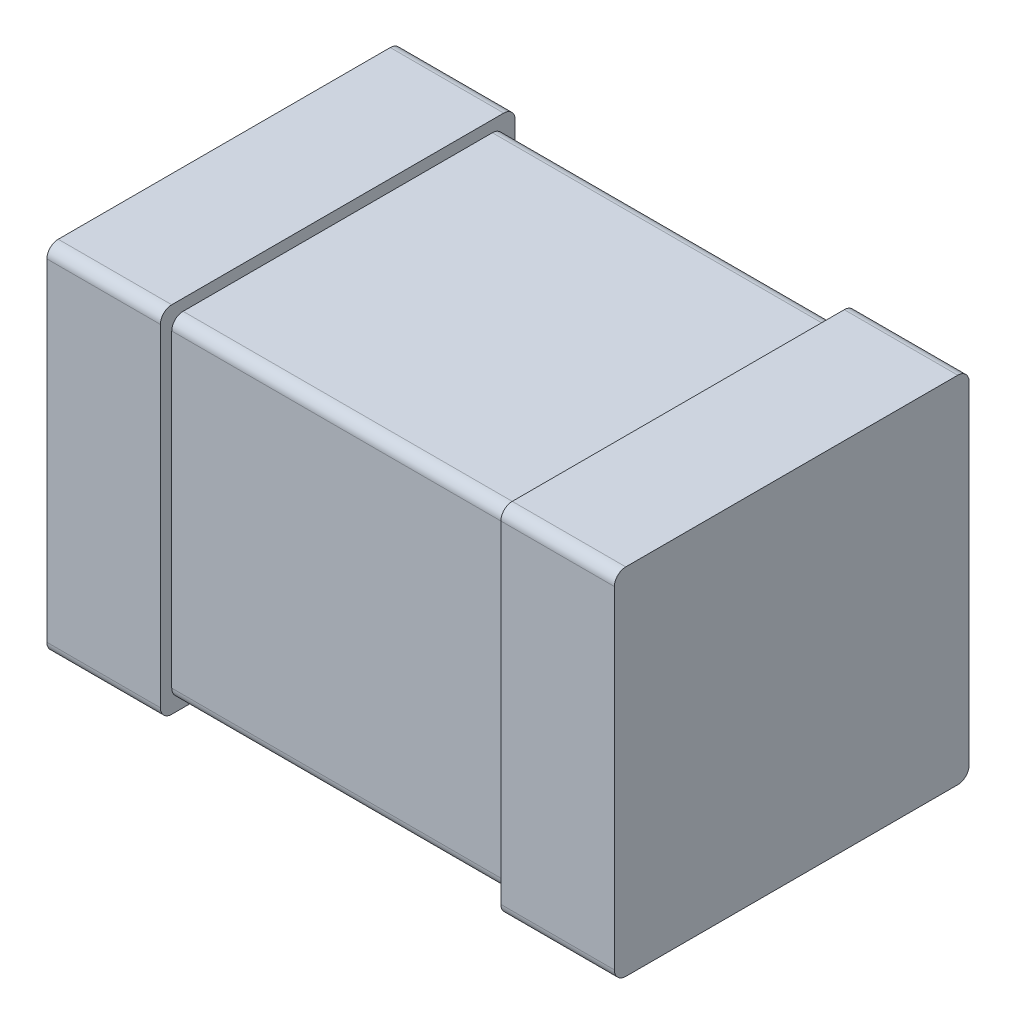
ISO-10303-21;
HEADER;
FILE_DESCRIPTION(('STEP AP214'),'2;1');
FILE_NAME('part.step','',(''),(''),'','','');
FILE_SCHEMA(('AUTOMOTIVE_DESIGN { 1 0 10303 214 1 1 1 1 }'));
ENDSEC;
DATA;
#1=APPLICATION_CONTEXT('core data for automotive mechanical design processes');
#2=APPLICATION_PROTOCOL_DEFINITION('international standard','automotive_design',2000,#1);
#3=PRODUCT_CONTEXT('',#1,'mechanical');
#4=PRODUCT('Part','Part','',(#3));
#5=PRODUCT_RELATED_PRODUCT_CATEGORY('part','',(#4));
#6=PRODUCT_DEFINITION_FORMATION('','',#4);
#7=PRODUCT_DEFINITION_CONTEXT('part definition',#1,'design');
#8=PRODUCT_DEFINITION('design','',#6,#7);
#9=PRODUCT_DEFINITION_SHAPE('','',#8);
#10=(LENGTH_UNIT() NAMED_UNIT(*) SI_UNIT(.MILLI.,.METRE.));
#11=(NAMED_UNIT(*) PLANE_ANGLE_UNIT() SI_UNIT($,.RADIAN.));
#12=(NAMED_UNIT(*) SI_UNIT($,.STERADIAN.) SOLID_ANGLE_UNIT());
#13=UNCERTAINTY_MEASURE_WITH_UNIT(LENGTH_MEASURE(1.E-05),#10,'distance_accuracy_value','');
#14=(GEOMETRIC_REPRESENTATION_CONTEXT(3) GLOBAL_UNCERTAINTY_ASSIGNED_CONTEXT((#13)) GLOBAL_UNIT_ASSIGNED_CONTEXT((#10,
#11,#12)) REPRESENTATION_CONTEXT('',''));
#15=CARTESIAN_POINT('',(0.,0.,0.));
#16=DIRECTION('',(0.,0.,1.));
#17=DIRECTION('',(1.,0.,0.));
#18=AXIS2_PLACEMENT_3D('',#15,#16,#17);
#19=CARTESIAN_POINT('',(-1.,-0.625,0.));
#20=DIRECTION('',(1.,0.,0.));
#21=DIRECTION('',(0.,1.,0.));
#22=AXIS2_PLACEMENT_3D('',#19,#20,#21);
#23=PLANE('',#22);
#24=CARTESIAN_POINT('',(-1.,-0.585,1.21));
#25=DIRECTION('',(-1.,0.,0.));
#26=DIRECTION('',(0.,0.,1.));
#27=AXIS2_PLACEMENT_3D('',#24,#25,#26);
#28=CIRCLE('',#27,0.04);
#29=CARTESIAN_POINT('',(-1.,-0.625,1.21));
#30=VERTEX_POINT('',#29);
#31=CARTESIAN_POINT('',(-1.,-0.585,1.25));
#32=VERTEX_POINT('',#31);
#33=EDGE_CURVE('E11',#30,#32,#28,.T.);
#34=ORIENTED_EDGE('',*,*,#33,.T.);
#35=DIRECTION('',(0.,1.,0.));
#36=VECTOR('',#35,1.);
#37=CARTESIAN_POINT('',(-1.,-0.625,1.25));
#38=LINE('',#37,#36);
#39=CARTESIAN_POINT('',(-1.,0.585,1.25));
#40=VERTEX_POINT('',#39);
#41=EDGE_CURVE('E27',#32,#40,#38,.T.);
#42=ORIENTED_EDGE('',*,*,#41,.T.);
#43=CARTESIAN_POINT('',(-1.,0.585,1.21));
#44=DIRECTION('',(1.,0.,0.));
#45=DIRECTION('',(0.,0.,1.));
#46=AXIS2_PLACEMENT_3D('',#43,#44,#45);
#47=CIRCLE('',#46,0.04);
#48=CARTESIAN_POINT('',(-1.,0.625,1.21));
#49=VERTEX_POINT('',#48);
#50=EDGE_CURVE('E176',#49,#40,#47,.T.);
#51=ORIENTED_EDGE('',*,*,#50,.F.);
#52=DIRECTION('',(0.,0.,1.));
#53=VECTOR('',#52,1.);
#54=CARTESIAN_POINT('',(-1.,0.625,0.));
#55=LINE('',#54,#53);
#56=CARTESIAN_POINT('',(-1.,0.625,0.04));
#57=VERTEX_POINT('',#56);
#58=EDGE_CURVE('E166',#57,#49,#55,.T.);
#59=ORIENTED_EDGE('',*,*,#58,.F.);
#60=CARTESIAN_POINT('',(-1.,0.585,0.04));
#61=DIRECTION('',(-1.,0.,0.));
#62=DIRECTION('',(0.,0.,1.));
#63=AXIS2_PLACEMENT_3D('',#60,#61,#62);
#64=CIRCLE('',#63,0.04);
#65=CARTESIAN_POINT('',(-1.,0.585,0.));
#66=VERTEX_POINT('',#65);
#67=EDGE_CURVE('E174',#57,#66,#64,.T.);
#68=ORIENTED_EDGE('',*,*,#67,.T.);
#69=DIRECTION('',(0.,1.,0.));
#70=VECTOR('',#69,1.);
#71=CARTESIAN_POINT('',(-1.,-0.625,0.));
#72=LINE('',#71,#70);
#73=CARTESIAN_POINT('',(-1.,-0.585,0.));
#74=VERTEX_POINT('',#73);
#75=EDGE_CURVE('E228',#74,#66,#72,.T.);
#76=ORIENTED_EDGE('',*,*,#75,.F.);
#77=CARTESIAN_POINT('',(-1.,-0.585,0.04));
#78=DIRECTION('',(1.,0.,0.));
#79=DIRECTION('',(0.,0.,1.));
#80=AXIS2_PLACEMENT_3D('',#77,#78,#79);
#81=CIRCLE('',#80,0.04);
#82=CARTESIAN_POINT('',(-1.,-0.625,0.04));
#83=VERTEX_POINT('',#82);
#84=EDGE_CURVE('E306',#83,#74,#81,.T.);
#85=ORIENTED_EDGE('',*,*,#84,.F.);
#86=DIRECTION('',(0.,0.,1.));
#87=VECTOR('',#86,1.);
#88=CARTESIAN_POINT('',(-1.,-0.625,0.));
#89=LINE('',#88,#87);
#90=EDGE_CURVE('E191',#83,#30,#89,.T.);
#91=ORIENTED_EDGE('',*,*,#90,.T.);
#92=EDGE_LOOP('',(#34,#42,#51,#59,#68,#76,#85,#91));
#93=FACE_BOUND('',#92,.T.);
#94=ADVANCED_FACE('F16',(#93),#23,.F.);
#95=CARTESIAN_POINT('',(-1.,-0.625,0.));
#96=DIRECTION('',(0.,1.,0.));
#97=DIRECTION('',(1.,0.,0.));
#98=AXIS2_PLACEMENT_3D('',#95,#96,#97);
#99=PLANE('',#98);
#100=DIRECTION('',(1.,0.,0.));
#101=VECTOR('',#100,1.);
#102=CARTESIAN_POINT('',(-1.,-0.625,1.21));
#103=LINE('',#102,#101);
#104=CARTESIAN_POINT('',(-0.6,-0.625,1.21));
#105=VERTEX_POINT('',#104);
#106=EDGE_CURVE('E489',#30,#105,#103,.T.);
#107=ORIENTED_EDGE('',*,*,#106,.F.);
#108=ORIENTED_EDGE('',*,*,#90,.F.);
#109=DIRECTION('',(1.,0.,0.));
#110=VECTOR('',#109,1.);
#111=CARTESIAN_POINT('',(-1.,-0.625,0.04));
#112=LINE('',#111,#110);
#113=CARTESIAN_POINT('',(-0.6,-0.625,0.04));
#114=VERTEX_POINT('',#113);
#115=EDGE_CURVE('E350',#83,#114,#112,.T.);
#116=ORIENTED_EDGE('',*,*,#115,.T.);
#117=DIRECTION('',(0.,0.,1.));
#118=VECTOR('',#117,1.);
#119=CARTESIAN_POINT('',(-0.6,-0.625,0.));
#120=LINE('',#119,#118);
#121=EDGE_CURVE('E310',#114,#105,#120,.T.);
#122=ORIENTED_EDGE('',*,*,#121,.T.);
#123=EDGE_LOOP('',(#107,#108,#116,#122));
#124=FACE_BOUND('',#123,.T.);
#125=ADVANCED_FACE('F579',(#124),#99,.F.);
#126=CARTESIAN_POINT('',(-1.,-0.585,0.04));
#127=DIRECTION('',(1.,0.,0.));
#128=DIRECTION('',(0.,-1.,0.));
#129=AXIS2_PLACEMENT_3D('',#126,#127,#128);
#130=CYLINDRICAL_SURFACE('',#129,0.04);
#131=ORIENTED_EDGE('',*,*,#84,.T.);
#132=DIRECTION('',(1.,0.,0.));
#133=VECTOR('',#132,1.);
#134=CARTESIAN_POINT('',(-1.,-0.585,0.));
#135=LINE('',#134,#133);
#136=CARTESIAN_POINT('',(-0.6,-0.585,0.));
#137=VERTEX_POINT('',#136);
#138=EDGE_CURVE('E311',#74,#137,#135,.T.);
#139=ORIENTED_EDGE('',*,*,#138,.T.);
#140=CARTESIAN_POINT('',(-0.6,-0.585,0.04));
#141=DIRECTION('',(1.,0.,0.));
#142=DIRECTION('',(0.,0.,1.));
#143=AXIS2_PLACEMENT_3D('',#140,#141,#142);
#144=CIRCLE('',#143,0.04);
#145=EDGE_CURVE('E331',#114,#137,#144,.T.);
#146=ORIENTED_EDGE('',*,*,#145,.F.);
#147=ORIENTED_EDGE('',*,*,#115,.F.);
#148=EDGE_LOOP('',(#131,#139,#146,#147));
#149=FACE_BOUND('',#148,.T.);
#150=ADVANCED_FACE('F581',(#149),#130,.T.);
#151=CARTESIAN_POINT('',(-1.,-0.585,1.21));
#152=DIRECTION('',(1.,0.,0.));
#153=DIRECTION('',(0.,-1.,0.));
#154=AXIS2_PLACEMENT_3D('',#151,#152,#153);
#155=CYLINDRICAL_SURFACE('',#154,0.04);
#156=ORIENTED_EDGE('',*,*,#106,.T.);
#157=CARTESIAN_POINT('',(-0.6,-0.585,1.21));
#158=DIRECTION('',(-1.,0.,0.));
#159=DIRECTION('',(0.,0.,1.));
#160=AXIS2_PLACEMENT_3D('',#157,#158,#159);
#161=CIRCLE('',#160,0.04);
#162=CARTESIAN_POINT('',(-0.6,-0.585,1.25));
#163=VERTEX_POINT('',#162);
#164=EDGE_CURVE('E500',#105,#163,#161,.T.);
#165=ORIENTED_EDGE('',*,*,#164,.T.);
#166=DIRECTION('',(1.,0.,0.));
#167=VECTOR('',#166,1.);
#168=CARTESIAN_POINT('',(-1.,-0.585,1.25));
#169=LINE('',#168,#167);
#170=EDGE_CURVE('E205',#32,#163,#169,.T.);
#171=ORIENTED_EDGE('',*,*,#170,.F.);
#172=ORIENTED_EDGE('',*,*,#33,.F.);
#173=EDGE_LOOP('',(#156,#165,#171,#172));
#174=FACE_BOUND('',#173,.T.);
#175=ADVANCED_FACE('F635',(#174),#155,.T.);
#176=CARTESIAN_POINT('',(-1.,-0.625,0.));
#177=DIRECTION('',(0.,0.,1.));
#178=DIRECTION('',(1.,0.,0.));
#179=AXIS2_PLACEMENT_3D('',#176,#177,#178);
#180=PLANE('',#179);
#181=DIRECTION('',(1.,0.,0.));
#182=VECTOR('',#181,1.);
#183=CARTESIAN_POINT('',(-1.,0.585,0.));
#184=LINE('',#183,#182);
#185=CARTESIAN_POINT('',(-0.6,0.585,0.));
#186=VERTEX_POINT('',#185);
#187=EDGE_CURVE('E189',#66,#186,#184,.T.);
#188=ORIENTED_EDGE('',*,*,#187,.T.);
#189=DIRECTION('',(0.,1.,0.));
#190=VECTOR('',#189,1.);
#191=CARTESIAN_POINT('',(-0.6,-0.625,0.));
#192=LINE('',#191,#190);
#193=EDGE_CURVE('E341',#137,#186,#192,.T.);
#194=ORIENTED_EDGE('',*,*,#193,.F.);
#195=ORIENTED_EDGE('',*,*,#138,.F.);
#196=ORIENTED_EDGE('',*,*,#75,.T.);
#197=EDGE_LOOP('',(#188,#194,#195,#196));
#198=FACE_BOUND('',#197,.T.);
#199=ADVANCED_FACE('F641',(#198),#180,.F.);
#200=CARTESIAN_POINT('',(-1.,-0.625,1.25));
#201=DIRECTION('',(0.,0.,1.));
#202=DIRECTION('',(1.,0.,0.));
#203=AXIS2_PLACEMENT_3D('',#200,#201,#202);
#204=PLANE('',#203);
#205=ORIENTED_EDGE('',*,*,#41,.F.);
#206=ORIENTED_EDGE('',*,*,#170,.T.);
#207=DIRECTION('',(0.,1.,0.));
#208=VECTOR('',#207,1.);
#209=CARTESIAN_POINT('',(-0.6,-0.625,1.25));
#210=LINE('',#209,#208);
#211=CARTESIAN_POINT('',(-0.6,0.585,1.25));
#212=VERTEX_POINT('',#211);
#213=EDGE_CURVE('E197',#163,#212,#210,.T.);
#214=ORIENTED_EDGE('',*,*,#213,.T.);
#215=DIRECTION('',(1.,0.,0.));
#216=VECTOR('',#215,1.);
#217=CARTESIAN_POINT('',(-1.,0.585,1.25));
#218=LINE('',#217,#216);
#219=EDGE_CURVE('E179',#40,#212,#218,.T.);
#220=ORIENTED_EDGE('',*,*,#219,.F.);
#221=EDGE_LOOP('',(#205,#206,#214,#220));
#222=FACE_BOUND('',#221,.T.);
#223=ADVANCED_FACE('F445',(#222),#204,.T.);
#224=CARTESIAN_POINT('',(-1.,0.585,0.04));
#225=DIRECTION('',(1.,0.,0.));
#226=DIRECTION('',(0.,1.,0.));
#227=AXIS2_PLACEMENT_3D('',#224,#225,#226);
#228=CYLINDRICAL_SURFACE('',#227,0.04);
#229=DIRECTION('',(1.,0.,0.));
#230=VECTOR('',#229,1.);
#231=CARTESIAN_POINT('',(-1.,0.625,0.04));
#232=LINE('',#231,#230);
#233=CARTESIAN_POINT('',(-0.6,0.625,0.04));
#234=VERTEX_POINT('',#233);
#235=EDGE_CURVE('E186',#57,#234,#232,.T.);
#236=ORIENTED_EDGE('',*,*,#235,.T.);
#237=CARTESIAN_POINT('',(-0.6,0.585,0.04));
#238=DIRECTION('',(-1.,0.,0.));
#239=DIRECTION('',(0.,0.,1.));
#240=AXIS2_PLACEMENT_3D('',#237,#238,#239);
#241=CIRCLE('',#240,0.04);
#242=EDGE_CURVE('E198',#234,#186,#241,.T.);
#243=ORIENTED_EDGE('',*,*,#242,.T.);
#244=ORIENTED_EDGE('',*,*,#187,.F.);
#245=ORIENTED_EDGE('',*,*,#67,.F.);
#246=EDGE_LOOP('',(#236,#243,#244,#245));
#247=FACE_BOUND('',#246,.T.);
#248=ADVANCED_FACE('F184',(#247),#228,.T.);
#249=CARTESIAN_POINT('',(-1.,0.585,1.21));
#250=DIRECTION('',(1.,0.,0.));
#251=DIRECTION('',(0.,1.,0.));
#252=AXIS2_PLACEMENT_3D('',#249,#250,#251);
#253=CYLINDRICAL_SURFACE('',#252,0.04);
#254=ORIENTED_EDGE('',*,*,#50,.T.);
#255=ORIENTED_EDGE('',*,*,#219,.T.);
#256=CARTESIAN_POINT('',(-0.6,0.585,1.21));
#257=DIRECTION('',(1.,0.,0.));
#258=DIRECTION('',(0.,0.,1.));
#259=AXIS2_PLACEMENT_3D('',#256,#257,#258);
#260=CIRCLE('',#259,0.04);
#261=CARTESIAN_POINT('',(-0.6,0.625,1.21));
#262=VERTEX_POINT('',#261);
#263=EDGE_CURVE('E427',#262,#212,#260,.T.);
#264=ORIENTED_EDGE('',*,*,#263,.F.);
#265=DIRECTION('',(1.,0.,0.));
#266=VECTOR('',#265,1.);
#267=CARTESIAN_POINT('',(-1.,0.625,1.21));
#268=LINE('',#267,#266);
#269=EDGE_CURVE('E180',#49,#262,#268,.T.);
#270=ORIENTED_EDGE('',*,*,#269,.F.);
#271=EDGE_LOOP('',(#254,#255,#264,#270));
#272=FACE_BOUND('',#271,.T.);
#273=ADVANCED_FACE('F454',(#272),#253,.T.);
#274=CARTESIAN_POINT('',(-1.,0.625,0.));
#275=DIRECTION('',(0.,1.,0.));
#276=DIRECTION('',(1.,0.,0.));
#277=AXIS2_PLACEMENT_3D('',#274,#275,#276);
#278=PLANE('',#277);
#279=DIRECTION('',(0.,0.,1.));
#280=VECTOR('',#279,1.);
#281=CARTESIAN_POINT('',(-0.6,0.625,0.));
#282=LINE('',#281,#280);
#283=EDGE_CURVE('E195',#234,#262,#282,.T.);
#284=ORIENTED_EDGE('',*,*,#283,.F.);
#285=ORIENTED_EDGE('',*,*,#235,.F.);
#286=ORIENTED_EDGE('',*,*,#58,.T.);
#287=ORIENTED_EDGE('',*,*,#269,.T.);
#288=EDGE_LOOP('',(#284,#285,#286,#287));
#289=FACE_BOUND('',#288,.T.);
#290=ADVANCED_FACE('F193',(#289),#278,.T.);
#291=CARTESIAN_POINT('',(-0.6,-0.625,0.));
#292=DIRECTION('',(1.,0.,0.));
#293=DIRECTION('',(0.,1.,0.));
#294=AXIS2_PLACEMENT_3D('',#291,#292,#293);
#295=PLANE('',#294);
#296=ORIENTED_EDGE('',*,*,#121,.F.);
#297=ORIENTED_EDGE('',*,*,#145,.T.);
#298=ORIENTED_EDGE('',*,*,#193,.T.);
#299=ORIENTED_EDGE('',*,*,#242,.F.);
#300=ORIENTED_EDGE('',*,*,#283,.T.);
#301=ORIENTED_EDGE('',*,*,#263,.T.);
#302=ORIENTED_EDGE('',*,*,#213,.F.);
#303=ORIENTED_EDGE('',*,*,#164,.F.);
#304=EDGE_LOOP('',(#296,#297,#298,#299,#300,#301,#302,#303));
#305=FACE_BOUND('',#304,.T.);
#306=CARTESIAN_POINT('',(-0.6,-0.545,0.08));
#307=DIRECTION('',(1.,0.,0.));
#308=DIRECTION('',(0.,0.,1.));
#309=AXIS2_PLACEMENT_3D('',#306,#307,#308);
#310=CIRCLE('',#309,0.04);
#311=CARTESIAN_POINT('',(-0.6,-0.585,0.08));
#312=VERTEX_POINT('',#311);
#313=CARTESIAN_POINT('',(-0.6,-0.545,0.04));
#314=VERTEX_POINT('',#313);
#315=EDGE_CURVE('E213',#312,#314,#310,.T.);
#316=ORIENTED_EDGE('',*,*,#315,.F.);
#317=DIRECTION('',(0.,0.,1.));
#318=VECTOR('',#317,1.);
#319=CARTESIAN_POINT('',(-0.6,-0.585,0.04));
#320=LINE('',#319,#318);
#321=CARTESIAN_POINT('',(-0.6,-0.585,1.17));
#322=VERTEX_POINT('',#321);
#323=EDGE_CURVE('E244',#312,#322,#320,.T.);
#324=ORIENTED_EDGE('',*,*,#323,.T.);
#325=CARTESIAN_POINT('',(-0.6,-0.545,1.17));
#326=DIRECTION('',(-1.,0.,0.));
#327=DIRECTION('',(0.,0.,1.));
#328=AXIS2_PLACEMENT_3D('',#325,#326,#327);
#329=CIRCLE('',#328,0.04);
#330=CARTESIAN_POINT('',(-0.6,-0.545,1.21));
#331=VERTEX_POINT('',#330);
#332=EDGE_CURVE('E75',#322,#331,#329,.T.);
#333=ORIENTED_EDGE('',*,*,#332,.T.);
#334=DIRECTION('',(0.,1.,0.));
#335=VECTOR('',#334,1.);
#336=CARTESIAN_POINT('',(-0.6,-0.585,1.21));
#337=LINE('',#336,#335);
#338=CARTESIAN_POINT('',(-0.6,0.545,1.21));
#339=VERTEX_POINT('',#338);
#340=EDGE_CURVE('E91',#331,#339,#337,.T.);
#341=ORIENTED_EDGE('',*,*,#340,.T.);
#342=CARTESIAN_POINT('',(-0.6,0.545,1.17));
#343=DIRECTION('',(1.,0.,0.));
#344=DIRECTION('',(0.,0.,1.));
#345=AXIS2_PLACEMENT_3D('',#342,#343,#344);
#346=CIRCLE('',#345,0.04);
#347=CARTESIAN_POINT('',(-0.6,0.585,1.17));
#348=VERTEX_POINT('',#347);
#349=EDGE_CURVE('E435',#348,#339,#346,.T.);
#350=ORIENTED_EDGE('',*,*,#349,.F.);
#351=DIRECTION('',(0.,0.,1.));
#352=VECTOR('',#351,1.);
#353=CARTESIAN_POINT('',(-0.6,0.585,0.04));
#354=LINE('',#353,#352);
#355=CARTESIAN_POINT('',(-0.6,0.585,0.08));
#356=VERTEX_POINT('',#355);
#357=EDGE_CURVE('E335',#356,#348,#354,.T.);
#358=ORIENTED_EDGE('',*,*,#357,.F.);
#359=CARTESIAN_POINT('',(-0.6,0.545,0.08));
#360=DIRECTION('',(-1.,0.,0.));
#361=DIRECTION('',(0.,0.,1.));
#362=AXIS2_PLACEMENT_3D('',#359,#360,#361);
#363=CIRCLE('',#362,0.04);
#364=CARTESIAN_POINT('',(-0.6,0.545,0.04));
#365=VERTEX_POINT('',#364);
#366=EDGE_CURVE('E216',#356,#365,#363,.T.);
#367=ORIENTED_EDGE('',*,*,#366,.T.);
#368=DIRECTION('',(0.,1.,0.));
#369=VECTOR('',#368,1.);
#370=CARTESIAN_POINT('',(-0.6,-0.585,0.04));
#371=LINE('',#370,#369);
#372=EDGE_CURVE('E222',#314,#365,#371,.T.);
#373=ORIENTED_EDGE('',*,*,#372,.F.);
#374=EDGE_LOOP('',(#316,#324,#333,#341,#350,#358,#367,#373));
#375=FACE_BOUND('',#374,.T.);
#376=ADVANCED_FACE('F451',(#305,#375),#295,.T.);
#377=CARTESIAN_POINT('',(-0.6,-0.545,0.08));
#378=DIRECTION('',(1.,0.,0.));
#379=DIRECTION('',(0.,-1.,0.));
#380=AXIS2_PLACEMENT_3D('',#377,#378,#379);
#381=CYLINDRICAL_SURFACE('',#380,0.04);
#382=ORIENTED_EDGE('',*,*,#315,.T.);
#383=DIRECTION('',(1.,0.,0.));
#384=VECTOR('',#383,1.);
#385=CARTESIAN_POINT('',(-0.6,-0.545,0.04));
#386=LINE('',#385,#384);
#387=CARTESIAN_POINT('',(0.6,-0.545,0.04));
#388=VERTEX_POINT('',#387);
#389=EDGE_CURVE('E217',#314,#388,#386,.T.);
#390=ORIENTED_EDGE('',*,*,#389,.T.);
#391=CARTESIAN_POINT('',(0.6,-0.545,0.08));
#392=DIRECTION('',(1.,0.,0.));
#393=DIRECTION('',(0.,0.,1.));
#394=AXIS2_PLACEMENT_3D('',#391,#392,#393);
#395=CIRCLE('',#394,0.04);
#396=CARTESIAN_POINT('',(0.6,-0.585,0.08));
#397=VERTEX_POINT('',#396);
#398=EDGE_CURVE('E239',#397,#388,#395,.T.);
#399=ORIENTED_EDGE('',*,*,#398,.F.);
#400=DIRECTION('',(1.,0.,0.));
#401=VECTOR('',#400,1.);
#402=CARTESIAN_POINT('',(-0.6,-0.585,0.08));
#403=LINE('',#402,#401);
#404=EDGE_CURVE('E278',#312,#397,#403,.T.);
#405=ORIENTED_EDGE('',*,*,#404,.F.);
#406=EDGE_LOOP('',(#382,#390,#399,#405));
#407=FACE_BOUND('',#406,.T.);
#408=ADVANCED_FACE('F658',(#407),#381,.T.);
#409=CARTESIAN_POINT('',(-0.6,-0.585,0.04));
#410=DIRECTION('',(0.,0.,1.));
#411=DIRECTION('',(1.,0.,0.));
#412=AXIS2_PLACEMENT_3D('',#409,#410,#411);
#413=PLANE('',#412);
#414=DIRECTION('',(1.,0.,0.));
#415=VECTOR('',#414,1.);
#416=CARTESIAN_POINT('',(-0.6,0.545,0.04));
#417=LINE('',#416,#415);
#418=CARTESIAN_POINT('',(0.6,0.545,0.04));
#419=VERTEX_POINT('',#418);
#420=EDGE_CURVE('E218',#365,#419,#417,.T.);
#421=ORIENTED_EDGE('',*,*,#420,.T.);
#422=DIRECTION('',(0.,1.,0.));
#423=VECTOR('',#422,1.);
#424=CARTESIAN_POINT('',(0.6,-0.585,0.04));
#425=LINE('',#424,#423);
#426=EDGE_CURVE('E229',#388,#419,#425,.T.);
#427=ORIENTED_EDGE('',*,*,#426,.F.);
#428=ORIENTED_EDGE('',*,*,#389,.F.);
#429=ORIENTED_EDGE('',*,*,#372,.T.);
#430=EDGE_LOOP('',(#421,#427,#428,#429));
#431=FACE_BOUND('',#430,.T.);
#432=ADVANCED_FACE('F662',(#431),#413,.F.);
#433=CARTESIAN_POINT('',(-0.6,0.545,0.08));
#434=DIRECTION('',(1.,0.,0.));
#435=DIRECTION('',(0.,1.,0.));
#436=AXIS2_PLACEMENT_3D('',#433,#434,#435);
#437=CYLINDRICAL_SURFACE('',#436,0.04);
#438=DIRECTION('',(1.,0.,0.));
#439=VECTOR('',#438,1.);
#440=CARTESIAN_POINT('',(-0.6,0.585,0.08));
#441=LINE('',#440,#439);
#442=CARTESIAN_POINT('',(0.6,0.585,0.08));
#443=VERTEX_POINT('',#442);
#444=EDGE_CURVE('E245',#356,#443,#441,.T.);
#445=ORIENTED_EDGE('',*,*,#444,.T.);
#446=CARTESIAN_POINT('',(0.6,0.545,0.08));
#447=DIRECTION('',(-1.,0.,0.));
#448=DIRECTION('',(0.,0.,1.));
#449=AXIS2_PLACEMENT_3D('',#446,#447,#448);
#450=CIRCLE('',#449,0.04);
#451=EDGE_CURVE('E249',#443,#419,#450,.T.);
#452=ORIENTED_EDGE('',*,*,#451,.T.);
#453=ORIENTED_EDGE('',*,*,#420,.F.);
#454=ORIENTED_EDGE('',*,*,#366,.F.);
#455=EDGE_LOOP('',(#445,#452,#453,#454));
#456=FACE_BOUND('',#455,.T.);
#457=ADVANCED_FACE('F688',(#456),#437,.T.);
#458=CARTESIAN_POINT('',(-0.6,0.585,0.04));
#459=DIRECTION('',(0.,1.,0.));
#460=DIRECTION('',(1.,0.,0.));
#461=AXIS2_PLACEMENT_3D('',#458,#459,#460);
#462=PLANE('',#461);
#463=DIRECTION('',(0.,0.,1.));
#464=VECTOR('',#463,1.);
#465=CARTESIAN_POINT('',(0.6,0.585,0.04));
#466=LINE('',#465,#464);
#467=CARTESIAN_POINT('',(0.6,0.585,1.17));
#468=VERTEX_POINT('',#467);
#469=EDGE_CURVE('E234',#443,#468,#466,.T.);
#470=ORIENTED_EDGE('',*,*,#469,.F.);
#471=ORIENTED_EDGE('',*,*,#444,.F.);
#472=ORIENTED_EDGE('',*,*,#357,.T.);
#473=DIRECTION('',(1.,0.,0.));
#474=VECTOR('',#473,1.);
#475=CARTESIAN_POINT('',(-0.6,0.585,1.17));
#476=LINE('',#475,#474);
#477=EDGE_CURVE('E423',#348,#468,#476,.T.);
#478=ORIENTED_EDGE('',*,*,#477,.T.);
#479=EDGE_LOOP('',(#470,#471,#472,#478));
#480=FACE_BOUND('',#479,.T.);
#481=ADVANCED_FACE('F553',(#480),#462,.T.);
#482=CARTESIAN_POINT('',(-0.6,0.545,1.17));
#483=DIRECTION('',(1.,0.,0.));
#484=DIRECTION('',(0.,1.,0.));
#485=AXIS2_PLACEMENT_3D('',#482,#483,#484);
#486=CYLINDRICAL_SURFACE('',#485,0.04);
#487=ORIENTED_EDGE('',*,*,#349,.T.);
#488=DIRECTION('',(1.,0.,0.));
#489=VECTOR('',#488,1.);
#490=CARTESIAN_POINT('',(-0.6,0.545,1.21));
#491=LINE('',#490,#489);
#492=CARTESIAN_POINT('',(0.6,0.545,1.21));
#493=VERTEX_POINT('',#492);
#494=EDGE_CURVE('E431',#339,#493,#491,.T.);
#495=ORIENTED_EDGE('',*,*,#494,.T.);
#496=CARTESIAN_POINT('',(0.6,0.545,1.17));
#497=DIRECTION('',(1.,0.,0.));
#498=DIRECTION('',(0.,0.,1.));
#499=AXIS2_PLACEMENT_3D('',#496,#497,#498);
#500=CIRCLE('',#499,0.04);
#501=EDGE_CURVE('E235',#468,#493,#500,.T.);
#502=ORIENTED_EDGE('',*,*,#501,.F.);
#503=ORIENTED_EDGE('',*,*,#477,.F.);
#504=EDGE_LOOP('',(#487,#495,#502,#503));
#505=FACE_BOUND('',#504,.T.);
#506=ADVANCED_FACE('F555',(#505),#486,.T.);
#507=CARTESIAN_POINT('',(-0.6,-0.585,1.21));
#508=DIRECTION('',(0.,0.,1.));
#509=DIRECTION('',(1.,0.,0.));
#510=AXIS2_PLACEMENT_3D('',#507,#508,#509);
#511=PLANE('',#510);
#512=ORIENTED_EDGE('',*,*,#340,.F.);
#513=DIRECTION('',(1.,0.,0.));
#514=VECTOR('',#513,1.);
#515=CARTESIAN_POINT('',(-0.6,-0.545,1.21));
#516=LINE('',#515,#514);
#517=CARTESIAN_POINT('',(0.6,-0.545,1.21));
#518=VERTEX_POINT('',#517);
#519=EDGE_CURVE('E272',#331,#518,#516,.T.);
#520=ORIENTED_EDGE('',*,*,#519,.T.);
#521=DIRECTION('',(0.,1.,0.));
#522=VECTOR('',#521,1.);
#523=CARTESIAN_POINT('',(0.6,-0.585,1.21));
#524=LINE('',#523,#522);
#525=EDGE_CURVE('E268',#518,#493,#524,.T.);
#526=ORIENTED_EDGE('',*,*,#525,.T.);
#527=ORIENTED_EDGE('',*,*,#494,.F.);
#528=EDGE_LOOP('',(#512,#520,#526,#527));
#529=FACE_BOUND('',#528,.T.);
#530=ADVANCED_FACE('F724',(#529),#511,.T.);
#531=CARTESIAN_POINT('',(-0.6,-0.545,1.17));
#532=DIRECTION('',(1.,0.,0.));
#533=DIRECTION('',(0.,-1.,0.));
#534=AXIS2_PLACEMENT_3D('',#531,#532,#533);
#535=CYLINDRICAL_SURFACE('',#534,0.04);
#536=DIRECTION('',(1.,0.,0.));
#537=VECTOR('',#536,1.);
#538=CARTESIAN_POINT('',(-0.6,-0.585,1.17));
#539=LINE('',#538,#537);
#540=CARTESIAN_POINT('',(0.6,-0.585,1.17));
#541=VERTEX_POINT('',#540);
#542=EDGE_CURVE('E273',#322,#541,#539,.T.);
#543=ORIENTED_EDGE('',*,*,#542,.T.);
#544=CARTESIAN_POINT('',(0.6,-0.545,1.17));
#545=DIRECTION('',(-1.,0.,0.));
#546=DIRECTION('',(0.,0.,1.));
#547=AXIS2_PLACEMENT_3D('',#544,#545,#546);
#548=CIRCLE('',#547,0.04);
#549=EDGE_CURVE('E274',#541,#518,#548,.T.);
#550=ORIENTED_EDGE('',*,*,#549,.T.);
#551=ORIENTED_EDGE('',*,*,#519,.F.);
#552=ORIENTED_EDGE('',*,*,#332,.F.);
#553=EDGE_LOOP('',(#543,#550,#551,#552));
#554=FACE_BOUND('',#553,.T.);
#555=ADVANCED_FACE('F362',(#554),#535,.T.);
#556=CARTESIAN_POINT('',(-0.6,-0.585,0.04));
#557=DIRECTION('',(0.,1.,0.));
#558=DIRECTION('',(1.,0.,0.));
#559=AXIS2_PLACEMENT_3D('',#556,#557,#558);
#560=PLANE('',#559);
#561=ORIENTED_EDGE('',*,*,#542,.F.);
#562=ORIENTED_EDGE('',*,*,#323,.F.);
#563=ORIENTED_EDGE('',*,*,#404,.T.);
#564=DIRECTION('',(0.,0.,1.));
#565=VECTOR('',#564,1.);
#566=CARTESIAN_POINT('',(0.6,-0.585,0.04));
#567=LINE('',#566,#565);
#568=EDGE_CURVE('E312',#397,#541,#567,.T.);
#569=ORIENTED_EDGE('',*,*,#568,.T.);
#570=EDGE_LOOP('',(#561,#562,#563,#569));
#571=FACE_BOUND('',#570,.T.);
#572=ADVANCED_FACE('F366',(#571),#560,.F.);
#573=CARTESIAN_POINT('',(0.6,-0.625,0.));
#574=DIRECTION('',(1.,0.,0.));
#575=DIRECTION('',(0.,1.,0.));
#576=AXIS2_PLACEMENT_3D('',#573,#574,#575);
#577=PLANE('',#576);
#578=CARTESIAN_POINT('',(0.6,-0.585,1.21));
#579=DIRECTION('',(-1.,0.,0.));
#580=DIRECTION('',(0.,0.,1.));
#581=AXIS2_PLACEMENT_3D('',#578,#579,#580);
#582=CIRCLE('',#581,0.04);
#583=CARTESIAN_POINT('',(0.6,-0.625,1.21));
#584=VERTEX_POINT('',#583);
#585=CARTESIAN_POINT('',(0.6,-0.585,1.25));
#586=VERTEX_POINT('',#585);
#587=EDGE_CURVE('E316',#584,#586,#582,.T.);
#588=ORIENTED_EDGE('',*,*,#587,.T.);
#589=DIRECTION('',(0.,1.,0.));
#590=VECTOR('',#589,1.);
#591=CARTESIAN_POINT('',(0.6,-0.625,1.25));
#592=LINE('',#591,#590);
#593=CARTESIAN_POINT('',(0.6,0.585,1.25));
#594=VERTEX_POINT('',#593);
#595=EDGE_CURVE('E289',#586,#594,#592,.T.);
#596=ORIENTED_EDGE('',*,*,#595,.T.);
#597=CARTESIAN_POINT('',(0.6,0.585,1.21));
#598=DIRECTION('',(1.,0.,0.));
#599=DIRECTION('',(0.,0.,1.));
#600=AXIS2_PLACEMENT_3D('',#597,#598,#599);
#601=CIRCLE('',#600,0.04);
#602=CARTESIAN_POINT('',(0.6,0.625,1.21));
#603=VERTEX_POINT('',#602);
#604=EDGE_CURVE('E303',#603,#594,#601,.T.);
#605=ORIENTED_EDGE('',*,*,#604,.F.);
#606=DIRECTION('',(0.,0.,1.));
#607=VECTOR('',#606,1.);
#608=CARTESIAN_POINT('',(0.6,0.625,0.));
#609=LINE('',#608,#607);
#610=CARTESIAN_POINT('',(0.6,0.625,0.04));
#611=VERTEX_POINT('',#610);
#612=EDGE_CURVE('E304',#611,#603,#609,.T.);
#613=ORIENTED_EDGE('',*,*,#612,.F.);
#614=CARTESIAN_POINT('',(0.6,0.585,0.04));
#615=DIRECTION('',(-1.,0.,0.));
#616=DIRECTION('',(0.,0.,1.));
#617=AXIS2_PLACEMENT_3D('',#614,#615,#616);
#618=CIRCLE('',#617,0.04);
#619=CARTESIAN_POINT('',(0.6,0.585,0.));
#620=VERTEX_POINT('',#619);
#621=EDGE_CURVE('E285',#611,#620,#618,.T.);
#622=ORIENTED_EDGE('',*,*,#621,.T.);
#623=DIRECTION('',(0.,1.,0.));
#624=VECTOR('',#623,1.);
#625=CARTESIAN_POINT('',(0.6,-0.625,0.));
#626=LINE('',#625,#624);
#627=CARTESIAN_POINT('',(0.6,-0.585,0.));
#628=VERTEX_POINT('',#627);
#629=EDGE_CURVE('E20',#628,#620,#626,.T.);
#630=ORIENTED_EDGE('',*,*,#629,.F.);
#631=CARTESIAN_POINT('',(0.6,-0.585,0.04));
#632=DIRECTION('',(1.,0.,0.));
#633=DIRECTION('',(0.,0.,1.));
#634=AXIS2_PLACEMENT_3D('',#631,#632,#633);
#635=CIRCLE('',#634,0.04);
#636=CARTESIAN_POINT('',(0.6,-0.625,0.04));
#637=VERTEX_POINT('',#636);
#638=EDGE_CURVE('E250',#637,#628,#635,.T.);
#639=ORIENTED_EDGE('',*,*,#638,.F.);
#640=DIRECTION('',(0.,0.,1.));
#641=VECTOR('',#640,1.);
#642=CARTESIAN_POINT('',(0.6,-0.625,0.));
#643=LINE('',#642,#641);
#644=EDGE_CURVE('E233',#637,#584,#643,.T.);
#645=ORIENTED_EDGE('',*,*,#644,.T.);
#646=EDGE_LOOP('',(#588,#596,#605,#613,#622,#630,#639,#645));
#647=FACE_BOUND('',#646,.T.);
#648=ORIENTED_EDGE('',*,*,#426,.T.);
#649=ORIENTED_EDGE('',*,*,#451,.F.);
#650=ORIENTED_EDGE('',*,*,#469,.T.);
#651=ORIENTED_EDGE('',*,*,#501,.T.);
#652=ORIENTED_EDGE('',*,*,#525,.F.);
#653=ORIENTED_EDGE('',*,*,#549,.F.);
#654=ORIENTED_EDGE('',*,*,#568,.F.);
#655=ORIENTED_EDGE('',*,*,#398,.T.);
#656=EDGE_LOOP('',(#648,#649,#650,#651,#652,#653,#654,#655));
#657=FACE_BOUND('',#656,.T.);
#658=ADVANCED_FACE('F369',(#647,#657),#577,.F.);
#659=CARTESIAN_POINT('',(0.6,-0.625,0.));
#660=DIRECTION('',(0.,1.,0.));
#661=DIRECTION('',(1.,0.,0.));
#662=AXIS2_PLACEMENT_3D('',#659,#660,#661);
#663=PLANE('',#662);
#664=DIRECTION('',(1.,0.,0.));
#665=VECTOR('',#664,1.);
#666=CARTESIAN_POINT('',(0.6,-0.625,1.21));
#667=LINE('',#666,#665);
#668=CARTESIAN_POINT('',(1.,-0.625,1.21));
#669=VERTEX_POINT('',#668);
#670=EDGE_CURVE('E260',#584,#669,#667,.T.);
#671=ORIENTED_EDGE('',*,*,#670,.F.);
#672=ORIENTED_EDGE('',*,*,#644,.F.);
#673=DIRECTION('',(1.,0.,0.));
#674=VECTOR('',#673,1.);
#675=CARTESIAN_POINT('',(0.6,-0.625,0.04));
#676=LINE('',#675,#674);
#677=CARTESIAN_POINT('',(1.,-0.625,0.04));
#678=VERTEX_POINT('',#677);
#679=EDGE_CURVE('E439',#637,#678,#676,.T.);
#680=ORIENTED_EDGE('',*,*,#679,.T.);
#681=DIRECTION('',(0.,0.,1.));
#682=VECTOR('',#681,1.);
#683=CARTESIAN_POINT('',(1.,-0.625,0.));
#684=LINE('',#683,#682);
#685=EDGE_CURVE('E253',#678,#669,#684,.T.);
#686=ORIENTED_EDGE('',*,*,#685,.T.);
#687=EDGE_LOOP('',(#671,#672,#680,#686));
#688=FACE_BOUND('',#687,.T.);
#689=ADVANCED_FACE('F706',(#688),#663,.F.);
#690=CARTESIAN_POINT('',(0.6,-0.585,0.04));
#691=DIRECTION('',(1.,0.,0.));
#692=DIRECTION('',(0.,-1.,0.));
#693=AXIS2_PLACEMENT_3D('',#690,#691,#692);
#694=CYLINDRICAL_SURFACE('',#693,0.04);
#695=ORIENTED_EDGE('',*,*,#638,.T.);
#696=DIRECTION('',(1.,0.,0.));
#697=VECTOR('',#696,1.);
#698=CARTESIAN_POINT('',(0.6,-0.585,0.));
#699=LINE('',#698,#697);
#700=CARTESIAN_POINT('',(1.,-0.585,0.));
#701=VERTEX_POINT('',#700);
#702=EDGE_CURVE('E254',#628,#701,#699,.T.);
#703=ORIENTED_EDGE('',*,*,#702,.T.);
#704=CARTESIAN_POINT('',(1.,-0.585,0.04));
#705=DIRECTION('',(1.,0.,0.));
#706=DIRECTION('',(0.,0.,1.));
#707=AXIS2_PLACEMENT_3D('',#704,#705,#706);
#708=CIRCLE('',#707,0.04);
#709=EDGE_CURVE('E279',#678,#701,#708,.T.);
#710=ORIENTED_EDGE('',*,*,#709,.F.);
#711=ORIENTED_EDGE('',*,*,#679,.F.);
#712=EDGE_LOOP('',(#695,#703,#710,#711));
#713=FACE_BOUND('',#712,.T.);
#714=ADVANCED_FACE('F527',(#713),#694,.T.);
#715=CARTESIAN_POINT('',(0.6,-0.585,1.21));
#716=DIRECTION('',(1.,0.,0.));
#717=DIRECTION('',(0.,-1.,0.));
#718=AXIS2_PLACEMENT_3D('',#715,#716,#717);
#719=CYLINDRICAL_SURFACE('',#718,0.04);
#720=ORIENTED_EDGE('',*,*,#670,.T.);
#721=CARTESIAN_POINT('',(1.,-0.585,1.21));
#722=DIRECTION('',(-1.,0.,0.));
#723=DIRECTION('',(0.,0.,1.));
#724=AXIS2_PLACEMENT_3D('',#721,#722,#723);
#725=CIRCLE('',#724,0.04);
#726=CARTESIAN_POINT('',(1.,-0.585,1.25));
#727=VERTEX_POINT('',#726);
#728=EDGE_CURVE('E256',#669,#727,#725,.T.);
#729=ORIENTED_EDGE('',*,*,#728,.T.);
#730=DIRECTION('',(1.,0.,0.));
#731=VECTOR('',#730,1.);
#732=CARTESIAN_POINT('',(0.6,-0.585,1.25));
#733=LINE('',#732,#731);
#734=EDGE_CURVE('E298',#586,#727,#733,.T.);
#735=ORIENTED_EDGE('',*,*,#734,.F.);
#736=ORIENTED_EDGE('',*,*,#587,.F.);
#737=EDGE_LOOP('',(#720,#729,#735,#736));
#738=FACE_BOUND('',#737,.T.);
#739=ADVANCED_FACE('F18',(#738),#719,.T.);
#740=CARTESIAN_POINT('',(0.6,-0.625,0.));
#741=DIRECTION('',(0.,0.,1.));
#742=DIRECTION('',(1.,0.,0.));
#743=AXIS2_PLACEMENT_3D('',#740,#741,#742);
#744=PLANE('',#743);
#745=DIRECTION('',(1.,0.,0.));
#746=VECTOR('',#745,1.);
#747=CARTESIAN_POINT('',(0.6,0.585,0.));
#748=LINE('',#747,#746);
#749=CARTESIAN_POINT('',(1.,0.585,0.));
#750=VERTEX_POINT('',#749);
#751=EDGE_CURVE('E261',#620,#750,#748,.T.);
#752=ORIENTED_EDGE('',*,*,#751,.T.);
#753=DIRECTION('',(0.,1.,0.));
#754=VECTOR('',#753,1.);
#755=CARTESIAN_POINT('',(1.,-0.625,0.));
#756=LINE('',#755,#754);
#757=EDGE_CURVE('E284',#701,#750,#756,.T.);
#758=ORIENTED_EDGE('',*,*,#757,.F.);
#759=ORIENTED_EDGE('',*,*,#702,.F.);
#760=ORIENTED_EDGE('',*,*,#629,.T.);
#761=EDGE_LOOP('',(#752,#758,#759,#760));
#762=FACE_BOUND('',#761,.T.);
#763=ADVANCED_FACE('F522',(#762),#744,.F.);
#764=CARTESIAN_POINT('',(0.6,-0.625,1.25));
#765=DIRECTION('',(0.,0.,1.));
#766=DIRECTION('',(1.,0.,0.));
#767=AXIS2_PLACEMENT_3D('',#764,#765,#766);
#768=PLANE('',#767);
#769=ORIENTED_EDGE('',*,*,#595,.F.);
#770=ORIENTED_EDGE('',*,*,#734,.T.);
#771=DIRECTION('',(0.,1.,0.));
#772=VECTOR('',#771,1.);
#773=CARTESIAN_POINT('',(1.,-0.625,1.25));
#774=LINE('',#773,#772);
#775=CARTESIAN_POINT('',(1.,0.585,1.25));
#776=VERTEX_POINT('',#775);
#777=EDGE_CURVE('E294',#727,#776,#774,.T.);
#778=ORIENTED_EDGE('',*,*,#777,.T.);
#779=DIRECTION('',(1.,0.,0.));
#780=VECTOR('',#779,1.);
#781=CARTESIAN_POINT('',(0.6,0.585,1.25));
#782=LINE('',#781,#780);
#783=EDGE_CURVE('E300',#594,#776,#782,.T.);
#784=ORIENTED_EDGE('',*,*,#783,.F.);
#785=EDGE_LOOP('',(#769,#770,#778,#784));
#786=FACE_BOUND('',#785,.T.);
#787=ADVANCED_FACE('F401',(#786),#768,.T.);
#788=CARTESIAN_POINT('',(0.6,0.585,0.04));
#789=DIRECTION('',(1.,0.,0.));
#790=DIRECTION('',(0.,1.,0.));
#791=AXIS2_PLACEMENT_3D('',#788,#789,#790);
#792=CYLINDRICAL_SURFACE('',#791,0.04);
#793=DIRECTION('',(1.,0.,0.));
#794=VECTOR('',#793,1.);
#795=CARTESIAN_POINT('',(0.6,0.625,0.04));
#796=LINE('',#795,#794);
#797=CARTESIAN_POINT('',(1.,0.625,0.04));
#798=VERTEX_POINT('',#797);
#799=EDGE_CURVE('E299',#611,#798,#796,.T.);
#800=ORIENTED_EDGE('',*,*,#799,.T.);
#801=CARTESIAN_POINT('',(1.,0.585,0.04));
#802=DIRECTION('',(-1.,0.,0.));
#803=DIRECTION('',(0.,0.,1.));
#804=AXIS2_PLACEMENT_3D('',#801,#802,#803);
#805=CIRCLE('',#804,0.04);
#806=EDGE_CURVE('E319',#798,#750,#805,.T.);
#807=ORIENTED_EDGE('',*,*,#806,.T.);
#808=ORIENTED_EDGE('',*,*,#751,.F.);
#809=ORIENTED_EDGE('',*,*,#621,.F.);
#810=EDGE_LOOP('',(#800,#807,#808,#809));
#811=FACE_BOUND('',#810,.T.);
#812=ADVANCED_FACE('F468',(#811),#792,.T.);
#813=CARTESIAN_POINT('',(0.6,0.585,1.21));
#814=DIRECTION('',(1.,0.,0.));
#815=DIRECTION('',(0.,1.,0.));
#816=AXIS2_PLACEMENT_3D('',#813,#814,#815);
#817=CYLINDRICAL_SURFACE('',#816,0.04);
#818=ORIENTED_EDGE('',*,*,#604,.T.);
#819=ORIENTED_EDGE('',*,*,#783,.T.);
#820=CARTESIAN_POINT('',(1.,0.585,1.21));
#821=DIRECTION('',(1.,0.,0.));
#822=DIRECTION('',(0.,0.,1.));
#823=AXIS2_PLACEMENT_3D('',#820,#821,#822);
#824=CIRCLE('',#823,0.04);
#825=CARTESIAN_POINT('',(1.,0.625,1.21));
#826=VERTEX_POINT('',#825);
#827=EDGE_CURVE('E211',#826,#776,#824,.T.);
#828=ORIENTED_EDGE('',*,*,#827,.F.);
#829=DIRECTION('',(1.,0.,0.));
#830=VECTOR('',#829,1.);
#831=CARTESIAN_POINT('',(0.6,0.625,1.21));
#832=LINE('',#831,#830);
#833=EDGE_CURVE('E283',#603,#826,#832,.T.);
#834=ORIENTED_EDGE('',*,*,#833,.F.);
#835=EDGE_LOOP('',(#818,#819,#828,#834));
#836=FACE_BOUND('',#835,.T.);
#837=ADVANCED_FACE('F391',(#836),#817,.T.);
#838=CARTESIAN_POINT('',(0.6,0.625,0.));
#839=DIRECTION('',(0.,1.,0.));
#840=DIRECTION('',(1.,0.,0.));
#841=AXIS2_PLACEMENT_3D('',#838,#839,#840);
#842=PLANE('',#841);
#843=DIRECTION('',(0.,0.,1.));
#844=VECTOR('',#843,1.);
#845=CARTESIAN_POINT('',(1.,0.625,0.));
#846=LINE('',#845,#844);
#847=EDGE_CURVE('E290',#798,#826,#846,.T.);
#848=ORIENTED_EDGE('',*,*,#847,.F.);
#849=ORIENTED_EDGE('',*,*,#799,.F.);
#850=ORIENTED_EDGE('',*,*,#612,.T.);
#851=ORIENTED_EDGE('',*,*,#833,.T.);
#852=EDGE_LOOP('',(#848,#849,#850,#851));
#853=FACE_BOUND('',#852,.T.);
#854=ADVANCED_FACE('F414',(#853),#842,.T.);
#855=CARTESIAN_POINT('',(1.,-0.625,0.));
#856=DIRECTION('',(1.,0.,0.));
#857=DIRECTION('',(0.,1.,0.));
#858=AXIS2_PLACEMENT_3D('',#855,#856,#857);
#859=PLANE('',#858);
#860=ORIENTED_EDGE('',*,*,#685,.F.);
#861=ORIENTED_EDGE('',*,*,#709,.T.);
#862=ORIENTED_EDGE('',*,*,#757,.T.);
#863=ORIENTED_EDGE('',*,*,#806,.F.);
#864=ORIENTED_EDGE('',*,*,#847,.T.);
#865=ORIENTED_EDGE('',*,*,#827,.T.);
#866=ORIENTED_EDGE('',*,*,#777,.F.);
#867=ORIENTED_EDGE('',*,*,#728,.F.);
#868=EDGE_LOOP('',(#860,#861,#862,#863,#864,#865,#866,#867));
#869=FACE_BOUND('',#868,.T.);
#870=ADVANCED_FACE('F405',(#869),#859,.T.);
#871=CLOSED_SHELL('',(#94,#125,#150,#175,#199,#223,#248,#273,#290,#376,#408,#432,#457,#481,#506,
#530,#555,#572,#658,#689,#714,#739,#763,#787,#812,#837,#854,#870));
#872=MANIFOLD_SOLID_BREP('B1',#871);
#873=ADVANCED_BREP_SHAPE_REPRESENTATION('',(#18,#872),#14);
#874=SHAPE_DEFINITION_REPRESENTATION(#9,#873);
ENDSEC;
END-ISO-10303-21;
